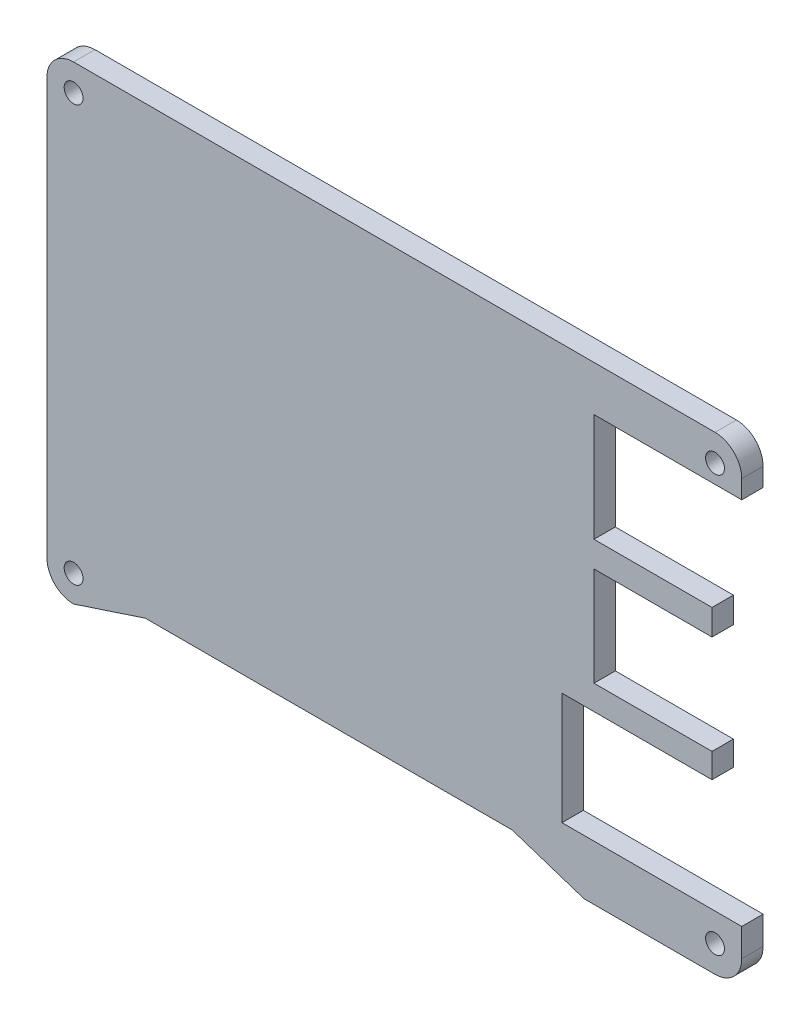
ISO-10303-21;
HEADER;
FILE_DESCRIPTION(('STEP AP214'),'2;1');
FILE_NAME('part.step','',(''),(''),'','','');
FILE_SCHEMA(('AUTOMOTIVE_DESIGN { 1 0 10303 214 1 1 1 1 }'));
ENDSEC;
DATA;
#1=APPLICATION_CONTEXT('core data for automotive mechanical design processes');
#2=APPLICATION_PROTOCOL_DEFINITION('international standard','automotive_design',2000,#1);
#3=PRODUCT_CONTEXT('',#1,'mechanical');
#4=PRODUCT('Part','Part','',(#3));
#5=PRODUCT_RELATED_PRODUCT_CATEGORY('part','',(#4));
#6=PRODUCT_DEFINITION_FORMATION('','',#4);
#7=PRODUCT_DEFINITION_CONTEXT('part definition',#1,'design');
#8=PRODUCT_DEFINITION('design','',#6,#7);
#9=PRODUCT_DEFINITION_SHAPE('','',#8);
#10=(LENGTH_UNIT() NAMED_UNIT(*) SI_UNIT(.MILLI.,.METRE.));
#11=(NAMED_UNIT(*) PLANE_ANGLE_UNIT() SI_UNIT($,.RADIAN.));
#12=(NAMED_UNIT(*) SI_UNIT($,.STERADIAN.) SOLID_ANGLE_UNIT());
#13=UNCERTAINTY_MEASURE_WITH_UNIT(LENGTH_MEASURE(1.E-05),#10,'distance_accuracy_value','');
#14=(GEOMETRIC_REPRESENTATION_CONTEXT(3) GLOBAL_UNCERTAINTY_ASSIGNED_CONTEXT((#13)) GLOBAL_UNIT_ASSIGNED_CONTEXT((#10,
#11,#12)) REPRESENTATION_CONTEXT('',''));
#15=CARTESIAN_POINT('',(0.,0.,0.));
#16=DIRECTION('',(0.,0.,1.));
#17=DIRECTION('',(1.,0.,0.));
#18=AXIS2_PLACEMENT_3D('',#15,#16,#17);
#19=CARTESIAN_POINT('',(0.,30.5076943043399,3.048));
#20=DIRECTION('',(0.,-1.,0.));
#21=DIRECTION('',(1.,0.,0.));
#22=AXIS2_PLACEMENT_3D('',#19,#20,#21);
#23=PLANE('',#22);
#24=DIRECTION('',(-1.,0.,0.));
#25=VECTOR('',#24,1.);
#26=CARTESIAN_POINT('',(0.,30.5076943043399,0.));
#27=LINE('',#26,#25);
#28=CARTESIAN_POINT('',(57.4049323750815,30.50769430434,0.));
#29=VERTEX_POINT('',#28);
#30=CARTESIAN_POINT('',(-34.0848926249185,30.5076943043399,0.));
#31=VERTEX_POINT('',#30);
#32=EDGE_CURVE('E236',#29,#31,#27,.T.);
#33=ORIENTED_EDGE('',*,*,#32,.T.);
#34=DIRECTION('',(0.,0.,-1.));
#35=VECTOR('',#34,1.);
#36=CARTESIAN_POINT('',(-34.0848926249185,30.5076943043399,3.048));
#37=LINE('',#36,#35);
#38=CARTESIAN_POINT('',(-34.0848926249185,30.5076943043399,3.048));
#39=VERTEX_POINT('',#38);
#40=EDGE_CURVE('E11',#39,#31,#37,.T.);
#41=ORIENTED_EDGE('',*,*,#40,.F.);
#42=DIRECTION('',(-1.,0.,0.));
#43=VECTOR('',#42,1.);
#44=CARTESIAN_POINT('',(0.,30.5076943043399,3.048));
#45=LINE('',#44,#43);
#46=CARTESIAN_POINT('',(57.4049323750815,30.50769430434,3.048));
#47=VERTEX_POINT('',#46);
#48=EDGE_CURVE('E404',#47,#39,#45,.T.);
#49=ORIENTED_EDGE('',*,*,#48,.F.);
#50=DIRECTION('',(0.,0.,-1.));
#51=VECTOR('',#50,1.);
#52=CARTESIAN_POINT('',(57.4049323750815,30.50769430434,3.048));
#53=LINE('',#52,#51);
#54=EDGE_CURVE('E223',#47,#29,#53,.T.);
#55=ORIENTED_EDGE('',*,*,#54,.T.);
#56=EDGE_LOOP('',(#33,#41,#49,#55));
#57=FACE_BOUND('',#56,.T.);
#58=ADVANCED_FACE('F35',(#57),#23,.F.);
#59=CARTESIAN_POINT('',(-34.0848926249185,26.69769430434,3.048));
#60=DIRECTION('',(0.,0.,-1.));
#61=DIRECTION('',(-1.,0.,0.));
#62=AXIS2_PLACEMENT_3D('',#59,#60,#61);
#63=CYLINDRICAL_SURFACE('',#62,3.80999999999996);
#64=CARTESIAN_POINT('',(-34.0848926249185,26.69769430434,0.));
#65=DIRECTION('',(0.,0.,1.));
#66=DIRECTION('',(1.,0.,0.));
#67=AXIS2_PLACEMENT_3D('',#64,#65,#66);
#68=CIRCLE('',#67,3.80999999999996);
#69=CARTESIAN_POINT('',(-37.8948926249184,26.69769430434,0.));
#70=VERTEX_POINT('',#69);
#71=EDGE_CURVE('E239',#31,#70,#68,.T.);
#72=ORIENTED_EDGE('',*,*,#71,.T.);
#73=DIRECTION('',(0.,0.,-1.));
#74=VECTOR('',#73,1.);
#75=CARTESIAN_POINT('',(-37.8948926249184,26.69769430434,3.048));
#76=LINE('',#75,#74);
#77=CARTESIAN_POINT('',(-37.8948926249184,26.69769430434,3.048));
#78=VERTEX_POINT('',#77);
#79=EDGE_CURVE('E44',#78,#70,#76,.T.);
#80=ORIENTED_EDGE('',*,*,#79,.F.);
#81=CARTESIAN_POINT('',(-34.0848926249185,26.69769430434,3.048));
#82=DIRECTION('',(0.,0.,1.));
#83=DIRECTION('',(1.,0.,0.));
#84=AXIS2_PLACEMENT_3D('',#81,#82,#83);
#85=CIRCLE('',#84,3.80999999999996);
#86=EDGE_CURVE('E139',#39,#78,#85,.T.);
#87=ORIENTED_EDGE('',*,*,#86,.F.);
#88=ORIENTED_EDGE('',*,*,#40,.T.);
#89=EDGE_LOOP('',(#72,#80,#87,#88));
#90=FACE_BOUND('',#89,.T.);
#91=ADVANCED_FACE('F419',(#90),#63,.T.);
#92=CARTESIAN_POINT('',(-37.8948926249184,0.,3.048));
#93=DIRECTION('',(1.,0.,0.));
#94=DIRECTION('',(0.,1.,0.));
#95=AXIS2_PLACEMENT_3D('',#92,#93,#94);
#96=PLANE('',#95);
#97=DIRECTION('',(0.,-1.,0.));
#98=VECTOR('',#97,1.);
#99=CARTESIAN_POINT('',(-37.8948926249184,0.,0.));
#100=LINE('',#99,#98);
#101=CARTESIAN_POINT('',(-37.8948926249185,-32.64100569566,0.));
#102=VERTEX_POINT('',#101);
#103=EDGE_CURVE('E241',#70,#102,#100,.T.);
#104=ORIENTED_EDGE('',*,*,#103,.T.);
#105=DIRECTION('',(0.,0.,-1.));
#106=VECTOR('',#105,1.);
#107=CARTESIAN_POINT('',(-37.8948926249185,-32.64100569566,3.048));
#108=LINE('',#107,#106);
#109=CARTESIAN_POINT('',(-37.8948926249185,-32.64100569566,3.048));
#110=VERTEX_POINT('',#109);
#111=EDGE_CURVE('E333',#110,#102,#108,.T.);
#112=ORIENTED_EDGE('',*,*,#111,.F.);
#113=DIRECTION('',(0.,-1.,0.));
#114=VECTOR('',#113,1.);
#115=CARTESIAN_POINT('',(-37.8948926249184,0.,3.048));
#116=LINE('',#115,#114);
#117=EDGE_CURVE('E341',#78,#110,#116,.T.);
#118=ORIENTED_EDGE('',*,*,#117,.F.);
#119=ORIENTED_EDGE('',*,*,#79,.T.);
#120=EDGE_LOOP('',(#104,#112,#118,#119));
#121=FACE_BOUND('',#120,.T.);
#122=ADVANCED_FACE('F339',(#121),#96,.F.);
#123=CARTESIAN_POINT('',(-34.0848926249185,-32.64100569566,3.048));
#124=DIRECTION('',(0.,0.,-1.));
#125=DIRECTION('',(-1.,0.,0.));
#126=AXIS2_PLACEMENT_3D('',#123,#124,#125);
#127=CYLINDRICAL_SURFACE('',#126,3.80999999999998);
#128=CARTESIAN_POINT('',(-34.0848926249185,-32.64100569566,0.));
#129=DIRECTION('',(0.,0.,1.));
#130=DIRECTION('',(1.,0.,0.));
#131=AXIS2_PLACEMENT_3D('',#128,#129,#130);
#132=CIRCLE('',#131,3.80999999999998);
#133=CARTESIAN_POINT('',(-34.0848926249185,-36.45100569566,0.));
#134=VERTEX_POINT('',#133);
#135=EDGE_CURVE('E243',#102,#134,#132,.T.);
#136=ORIENTED_EDGE('',*,*,#135,.T.);
#137=DIRECTION('',(0.,0.,-1.));
#138=VECTOR('',#137,1.);
#139=CARTESIAN_POINT('',(-34.0848926249185,-36.45100569566,3.048));
#140=LINE('',#139,#138);
#141=CARTESIAN_POINT('',(-34.0848926249185,-36.45100569566,3.048));
#142=VERTEX_POINT('',#141);
#143=EDGE_CURVE('E330',#142,#134,#140,.T.);
#144=ORIENTED_EDGE('',*,*,#143,.F.);
#145=CARTESIAN_POINT('',(-34.0848926249185,-32.64100569566,3.048));
#146=DIRECTION('',(0.,0.,1.));
#147=DIRECTION('',(1.,0.,0.));
#148=AXIS2_PLACEMENT_3D('',#145,#146,#147);
#149=CIRCLE('',#148,3.80999999999998);
#150=EDGE_CURVE('E359',#110,#142,#149,.T.);
#151=ORIENTED_EDGE('',*,*,#150,.F.);
#152=ORIENTED_EDGE('',*,*,#111,.T.);
#153=EDGE_LOOP('',(#136,#144,#151,#152));
#154=FACE_BOUND('',#153,.T.);
#155=ADVANCED_FACE('F350',(#154),#127,.T.);
#156=CARTESIAN_POINT('',(7.49015762515094,-22.7823959132495,3.048));
#157=DIRECTION('',(-0.312323139313539,0.949975924247207,0.));
#158=DIRECTION('',(-0.949975924247207,-0.312323139313539,0.));
#159=AXIS2_PLACEMENT_3D('',#156,#157,#158);
#160=PLANE('',#159);
#161=DIRECTION('',(0.949975924247208,0.312323139313539,0.));
#162=VECTOR('',#161,1.);
#163=CARTESIAN_POINT('',(7.49015762515094,-22.7823959132495,0.));
#164=LINE('',#163,#162);
#165=CARTESIAN_POINT('',(-23.8448926249185,-33.08440569566,0.));
#166=VERTEX_POINT('',#165);
#167=EDGE_CURVE('E245',#134,#166,#164,.T.);
#168=ORIENTED_EDGE('',*,*,#167,.T.);
#169=DIRECTION('',(0.,0.,-1.));
#170=VECTOR('',#169,1.);
#171=CARTESIAN_POINT('',(-23.8448926249185,-33.08440569566,3.048));
#172=LINE('',#171,#170);
#173=CARTESIAN_POINT('',(-23.8448926249185,-33.08440569566,3.048));
#174=VERTEX_POINT('',#173);
#175=EDGE_CURVE('E327',#174,#166,#172,.T.);
#176=ORIENTED_EDGE('',*,*,#175,.F.);
#177=DIRECTION('',(0.949975924247208,0.312323139313539,0.));
#178=VECTOR('',#177,1.);
#179=CARTESIAN_POINT('',(7.49015762515094,-22.7823959132495,3.048));
#180=LINE('',#179,#178);
#181=EDGE_CURVE('E356',#142,#174,#180,.T.);
#182=ORIENTED_EDGE('',*,*,#181,.F.);
#183=ORIENTED_EDGE('',*,*,#143,.T.);
#184=EDGE_LOOP('',(#168,#176,#182,#183));
#185=FACE_BOUND('',#184,.T.);
#186=ADVANCED_FACE('F354',(#185),#160,.F.);
#187=CARTESIAN_POINT('',(0.,-33.08440569566,3.048));
#188=DIRECTION('',(0.,1.,0.));
#189=DIRECTION('',(-1.,0.,0.));
#190=AXIS2_PLACEMENT_3D('',#187,#188,#189);
#191=PLANE('',#190);
#192=DIRECTION('',(1.,0.,0.));
#193=VECTOR('',#192,1.);
#194=CARTESIAN_POINT('',(0.,-33.08440569566,0.));
#195=LINE('',#194,#193);
#196=CARTESIAN_POINT('',(28.4743073750815,-33.08440569566,0.));
#197=VERTEX_POINT('',#196);
#198=EDGE_CURVE('E247',#166,#197,#195,.T.);
#199=ORIENTED_EDGE('',*,*,#198,.T.);
#200=DIRECTION('',(0.,0.,-1.));
#201=VECTOR('',#200,1.);
#202=CARTESIAN_POINT('',(28.4743073750815,-33.08440569566,3.048));
#203=LINE('',#202,#201);
#204=CARTESIAN_POINT('',(28.4743073750815,-33.08440569566,3.048));
#205=VERTEX_POINT('',#204);
#206=EDGE_CURVE('E324',#205,#197,#203,.T.);
#207=ORIENTED_EDGE('',*,*,#206,.F.);
#208=DIRECTION('',(1.,0.,0.));
#209=VECTOR('',#208,1.);
#210=CARTESIAN_POINT('',(0.,-33.08440569566,3.048));
#211=LINE('',#210,#209);
#212=EDGE_CURVE('E358',#174,#205,#211,.T.);
#213=ORIENTED_EDGE('',*,*,#212,.F.);
#214=ORIENTED_EDGE('',*,*,#175,.T.);
#215=EDGE_LOOP('',(#199,#207,#213,#214));
#216=FACE_BOUND('',#215,.T.);
#217=ADVANCED_FACE('F639',(#216),#191,.F.);
#218=CARTESIAN_POINT('',(-7.03857792206775,-21.4088510431814,3.048));
#219=DIRECTION('',(0.312323139313538,0.949975924247208,0.));
#220=DIRECTION('',(-0.949975924247208,0.312323139313538,0.));
#221=AXIS2_PLACEMENT_3D('',#218,#219,#220);
#222=PLANE('',#221);
#223=DIRECTION('',(0.949975924247208,-0.312323139313538,0.));
#224=VECTOR('',#223,1.);
#225=CARTESIAN_POINT('',(-7.03857792206775,-21.4088510431814,0.));
#226=LINE('',#225,#224);
#227=CARTESIAN_POINT('',(38.7143073750815,-36.45100569566,0.));
#228=VERTEX_POINT('',#227);
#229=EDGE_CURVE('E249',#197,#228,#226,.T.);
#230=ORIENTED_EDGE('',*,*,#229,.T.);
#231=DIRECTION('',(0.,0.,-1.));
#232=VECTOR('',#231,1.);
#233=CARTESIAN_POINT('',(38.7143073750815,-36.45100569566,3.048));
#234=LINE('',#233,#232);
#235=CARTESIAN_POINT('',(38.7143073750815,-36.45100569566,3.048));
#236=VERTEX_POINT('',#235);
#237=EDGE_CURVE('E321',#236,#228,#234,.T.);
#238=ORIENTED_EDGE('',*,*,#237,.F.);
#239=DIRECTION('',(0.949975924247208,-0.312323139313538,0.));
#240=VECTOR('',#239,1.);
#241=CARTESIAN_POINT('',(-7.03857792206775,-21.4088510431814,3.048));
#242=LINE('',#241,#240);
#243=EDGE_CURVE('E361',#205,#236,#242,.T.);
#244=ORIENTED_EDGE('',*,*,#243,.F.);
#245=ORIENTED_EDGE('',*,*,#206,.T.);
#246=EDGE_LOOP('',(#230,#238,#244,#245));
#247=FACE_BOUND('',#246,.T.);
#248=ADVANCED_FACE('F629',(#247),#222,.F.);
#249=CARTESIAN_POINT('',(0.,-36.45100569566,3.048));
#250=DIRECTION('',(0.,1.,0.));
#251=DIRECTION('',(0.,0.,1.));
#252=AXIS2_PLACEMENT_3D('',#249,#250,#251);
#253=PLANE('',#252);
#254=DIRECTION('',(1.,0.,0.));
#255=VECTOR('',#254,1.);
#256=CARTESIAN_POINT('',(0.,-36.45100569566,0.));
#257=LINE('',#256,#255);
#258=CARTESIAN_POINT('',(57.4050073750816,-36.45100569566,0.));
#259=VERTEX_POINT('',#258);
#260=EDGE_CURVE('E251',#228,#259,#257,.T.);
#261=ORIENTED_EDGE('',*,*,#260,.T.);
#262=DIRECTION('',(0.,0.,-1.));
#263=VECTOR('',#262,1.);
#264=CARTESIAN_POINT('',(57.4050073750816,-36.45100569566,3.048));
#265=LINE('',#264,#263);
#266=CARTESIAN_POINT('',(57.4050073750816,-36.45100569566,3.048));
#267=VERTEX_POINT('',#266);
#268=EDGE_CURVE('E318',#267,#259,#265,.T.);
#269=ORIENTED_EDGE('',*,*,#268,.F.);
#270=DIRECTION('',(1.,0.,0.));
#271=VECTOR('',#270,1.);
#272=CARTESIAN_POINT('',(0.,-36.45100569566,3.048));
#273=LINE('',#272,#271);
#274=EDGE_CURVE('E367',#236,#267,#273,.T.);
#275=ORIENTED_EDGE('',*,*,#274,.F.);
#276=ORIENTED_EDGE('',*,*,#237,.T.);
#277=EDGE_LOOP('',(#261,#269,#275,#276));
#278=FACE_BOUND('',#277,.T.);
#279=ADVANCED_FACE('F619',(#278),#253,.F.);
#280=CARTESIAN_POINT('',(57.4050073750816,-32.64100569566,3.048));
#281=DIRECTION('',(0.,0.,-1.));
#282=DIRECTION('',(-1.,0.,0.));
#283=AXIS2_PLACEMENT_3D('',#280,#281,#282);
#284=CYLINDRICAL_SURFACE('',#283,3.81);
#285=CARTESIAN_POINT('',(57.4050073750816,-32.64100569566,0.));
#286=DIRECTION('',(0.,0.,1.));
#287=DIRECTION('',(1.,0.,0.));
#288=AXIS2_PLACEMENT_3D('',#285,#286,#287);
#289=CIRCLE('',#288,3.81);
#290=CARTESIAN_POINT('',(61.2149073750816,-32.6134015293044,0.));
#291=VERTEX_POINT('',#290);
#292=EDGE_CURVE('E253',#259,#291,#289,.T.);
#293=ORIENTED_EDGE('',*,*,#292,.T.);
#294=DIRECTION('',(0.,0.,-1.));
#295=VECTOR('',#294,1.);
#296=CARTESIAN_POINT('',(61.2149073750816,-32.6134015293044,3.048));
#297=LINE('',#296,#295);
#298=CARTESIAN_POINT('',(61.2149073750816,-32.6134015293044,3.048));
#299=VERTEX_POINT('',#298);
#300=EDGE_CURVE('E315',#299,#291,#297,.T.);
#301=ORIENTED_EDGE('',*,*,#300,.F.);
#302=CARTESIAN_POINT('',(57.4050073750816,-32.64100569566,3.048));
#303=DIRECTION('',(0.,0.,1.));
#304=DIRECTION('',(1.,0.,0.));
#305=AXIS2_PLACEMENT_3D('',#302,#303,#304);
#306=CIRCLE('',#305,3.81);
#307=EDGE_CURVE('E369',#267,#299,#306,.T.);
#308=ORIENTED_EDGE('',*,*,#307,.F.);
#309=ORIENTED_EDGE('',*,*,#268,.T.);
#310=EDGE_LOOP('',(#293,#301,#308,#309));
#311=FACE_BOUND('',#310,.T.);
#312=ADVANCED_FACE('F609',(#311),#284,.T.);
#313=CARTESIAN_POINT('',(61.2149073750816,0.,3.048));
#314=DIRECTION('',(-1.,0.,0.));
#315=DIRECTION('',(0.,0.,1.));
#316=AXIS2_PLACEMENT_3D('',#313,#314,#315);
#317=PLANE('',#316);
#318=DIRECTION('',(0.,1.,0.));
#319=VECTOR('',#318,1.);
#320=CARTESIAN_POINT('',(61.2149073750816,0.,0.));
#321=LINE('',#320,#319);
#322=CARTESIAN_POINT('',(61.2149073750816,-28.62780569566,0.));
#323=VERTEX_POINT('',#322);
#324=EDGE_CURVE('E255',#291,#323,#321,.T.);
#325=ORIENTED_EDGE('',*,*,#324,.T.);
#326=DIRECTION('',(0.,0.,-1.));
#327=VECTOR('',#326,1.);
#328=CARTESIAN_POINT('',(61.2149073750816,-28.62780569566,3.048));
#329=LINE('',#328,#327);
#330=CARTESIAN_POINT('',(61.2149073750816,-28.62780569566,3.048));
#331=VERTEX_POINT('',#330);
#332=EDGE_CURVE('E312',#331,#323,#329,.T.);
#333=ORIENTED_EDGE('',*,*,#332,.F.);
#334=DIRECTION('',(0.,1.,0.));
#335=VECTOR('',#334,1.);
#336=CARTESIAN_POINT('',(61.2149073750816,0.,3.048));
#337=LINE('',#336,#335);
#338=EDGE_CURVE('E371',#299,#331,#337,.T.);
#339=ORIENTED_EDGE('',*,*,#338,.F.);
#340=ORIENTED_EDGE('',*,*,#300,.T.);
#341=EDGE_LOOP('',(#325,#333,#339,#340));
#342=FACE_BOUND('',#341,.T.);
#343=ADVANCED_FACE('F599',(#342),#317,.F.);
#344=CARTESIAN_POINT('',(0.,-28.62780569566,3.048));
#345=DIRECTION('',(0.,-1.,0.));
#346=DIRECTION('',(0.,0.,-1.));
#347=AXIS2_PLACEMENT_3D('',#344,#345,#346);
#348=PLANE('',#347);
#349=DIRECTION('',(-1.,0.,0.));
#350=VECTOR('',#349,1.);
#351=CARTESIAN_POINT('',(0.,-28.62780569566,0.));
#352=LINE('',#351,#350);
#353=CARTESIAN_POINT('',(35.5750073750816,-28.62780569566,0.));
#354=VERTEX_POINT('',#353);
#355=EDGE_CURVE('E257',#323,#354,#352,.T.);
#356=ORIENTED_EDGE('',*,*,#355,.T.);
#357=DIRECTION('',(0.,0.,-1.));
#358=VECTOR('',#357,1.);
#359=CARTESIAN_POINT('',(35.5750073750816,-28.62780569566,3.048));
#360=LINE('',#359,#358);
#361=CARTESIAN_POINT('',(35.5750073750816,-28.62780569566,3.048));
#362=VERTEX_POINT('',#361);
#363=EDGE_CURVE('E309',#362,#354,#360,.T.);
#364=ORIENTED_EDGE('',*,*,#363,.F.);
#365=DIRECTION('',(-1.,0.,0.));
#366=VECTOR('',#365,1.);
#367=CARTESIAN_POINT('',(0.,-28.62780569566,3.048));
#368=LINE('',#367,#366);
#369=EDGE_CURVE('E373',#331,#362,#368,.T.);
#370=ORIENTED_EDGE('',*,*,#369,.F.);
#371=ORIENTED_EDGE('',*,*,#332,.T.);
#372=EDGE_LOOP('',(#356,#364,#370,#371));
#373=FACE_BOUND('',#372,.T.);
#374=ADVANCED_FACE('F589',(#373),#348,.F.);
#375=CARTESIAN_POINT('',(35.5750073750816,0.,3.048));
#376=DIRECTION('',(-1.,0.,0.));
#377=DIRECTION('',(0.,0.,1.));
#378=AXIS2_PLACEMENT_3D('',#375,#376,#377);
#379=PLANE('',#378);
#380=DIRECTION('',(0.,1.,0.));
#381=VECTOR('',#380,1.);
#382=CARTESIAN_POINT('',(35.5750073750816,0.,0.));
#383=LINE('',#382,#381);
#384=CARTESIAN_POINT('',(35.5750073750816,-12.62800569566,0.));
#385=VERTEX_POINT('',#384);
#386=EDGE_CURVE('E259',#354,#385,#383,.T.);
#387=ORIENTED_EDGE('',*,*,#386,.T.);
#388=DIRECTION('',(0.,0.,-1.));
#389=VECTOR('',#388,1.);
#390=CARTESIAN_POINT('',(35.5750073750816,-12.62800569566,3.048));
#391=LINE('',#390,#389);
#392=CARTESIAN_POINT('',(35.5750073750816,-12.62800569566,3.048));
#393=VERTEX_POINT('',#392);
#394=EDGE_CURVE('E306',#393,#385,#391,.T.);
#395=ORIENTED_EDGE('',*,*,#394,.F.);
#396=DIRECTION('',(0.,1.,0.));
#397=VECTOR('',#396,1.);
#398=CARTESIAN_POINT('',(35.5750073750816,0.,3.048));
#399=LINE('',#398,#397);
#400=EDGE_CURVE('E375',#362,#393,#399,.T.);
#401=ORIENTED_EDGE('',*,*,#400,.F.);
#402=ORIENTED_EDGE('',*,*,#363,.T.);
#403=EDGE_LOOP('',(#387,#395,#401,#402));
#404=FACE_BOUND('',#403,.T.);
#405=ADVANCED_FACE('F579',(#404),#379,.F.);
#406=CARTESIAN_POINT('',(0.,-12.62800569566,3.048));
#407=DIRECTION('',(0.,1.,0.));
#408=DIRECTION('',(-1.,0.,0.));
#409=AXIS2_PLACEMENT_3D('',#406,#407,#408);
#410=PLANE('',#409);
#411=DIRECTION('',(1.,0.,0.));
#412=VECTOR('',#411,1.);
#413=CARTESIAN_POINT('',(0.,-12.62800569566,0.));
#414=LINE('',#413,#412);
#415=CARTESIAN_POINT('',(56.9750073750815,-12.62800569566,0.));
#416=VERTEX_POINT('',#415);
#417=EDGE_CURVE('E261',#385,#416,#414,.T.);
#418=ORIENTED_EDGE('',*,*,#417,.T.);
#419=DIRECTION('',(0.,0.,-1.));
#420=VECTOR('',#419,1.);
#421=CARTESIAN_POINT('',(56.9750073750815,-12.62800569566,3.048));
#422=LINE('',#421,#420);
#423=CARTESIAN_POINT('',(56.9750073750815,-12.62800569566,3.048));
#424=VERTEX_POINT('',#423);
#425=EDGE_CURVE('E303',#424,#416,#422,.T.);
#426=ORIENTED_EDGE('',*,*,#425,.F.);
#427=DIRECTION('',(1.,0.,0.));
#428=VECTOR('',#427,1.);
#429=CARTESIAN_POINT('',(0.,-12.62800569566,3.048));
#430=LINE('',#429,#428);
#431=EDGE_CURVE('E377',#393,#424,#430,.T.);
#432=ORIENTED_EDGE('',*,*,#431,.F.);
#433=ORIENTED_EDGE('',*,*,#394,.T.);
#434=EDGE_LOOP('',(#418,#426,#432,#433));
#435=FACE_BOUND('',#434,.T.);
#436=ADVANCED_FACE('F569',(#435),#410,.F.);
#437=CARTESIAN_POINT('',(56.9750073750815,0.,3.048));
#438=DIRECTION('',(-1.,0.,0.));
#439=DIRECTION('',(0.,0.,1.));
#440=AXIS2_PLACEMENT_3D('',#437,#438,#439);
#441=PLANE('',#440);
#442=DIRECTION('',(0.,1.,0.));
#443=VECTOR('',#442,1.);
#444=CARTESIAN_POINT('',(56.9750073750815,0.,0.));
#445=LINE('',#444,#443);
#446=CARTESIAN_POINT('',(56.9750073750815,-9.12180569566001,0.));
#447=VERTEX_POINT('',#446);
#448=EDGE_CURVE('E263',#416,#447,#445,.T.);
#449=ORIENTED_EDGE('',*,*,#448,.T.);
#450=DIRECTION('',(0.,0.,-1.));
#451=VECTOR('',#450,1.);
#452=CARTESIAN_POINT('',(56.9750073750815,-9.12180569566001,3.048));
#453=LINE('',#452,#451);
#454=CARTESIAN_POINT('',(56.9750073750815,-9.12180569566001,3.048));
#455=VERTEX_POINT('',#454);
#456=EDGE_CURVE('E301',#455,#447,#453,.T.);
#457=ORIENTED_EDGE('',*,*,#456,.F.);
#458=DIRECTION('',(0.,1.,0.));
#459=VECTOR('',#458,1.);
#460=CARTESIAN_POINT('',(56.9750073750815,0.,3.048));
#461=LINE('',#460,#459);
#462=EDGE_CURVE('E379',#424,#455,#461,.T.);
#463=ORIENTED_EDGE('',*,*,#462,.F.);
#464=ORIENTED_EDGE('',*,*,#425,.T.);
#465=EDGE_LOOP('',(#449,#457,#463,#464));
#466=FACE_BOUND('',#465,.T.);
#467=ADVANCED_FACE('F559',(#466),#441,.F.);
#468=CARTESIAN_POINT('',(0.,-9.12180569566001,3.048));
#469=DIRECTION('',(0.,1.,0.));
#470=DIRECTION('',(0.,0.,1.));
#471=AXIS2_PLACEMENT_3D('',#468,#469,#470);
#472=PLANE('',#471);
#473=DIRECTION('',(1.,0.,0.));
#474=VECTOR('',#473,1.);
#475=CARTESIAN_POINT('',(0.,-9.12180569566001,0.));
#476=LINE('',#475,#474);
#477=CARTESIAN_POINT('',(40.1348073750816,-9.12180569566001,0.));
#478=VERTEX_POINT('',#477);
#479=EDGE_CURVE('E266',#478,#447,#476,.T.);
#480=ORIENTED_EDGE('',*,*,#479,.F.);
#481=DIRECTION('',(0.,0.,-1.));
#482=VECTOR('',#481,1.);
#483=CARTESIAN_POINT('',(40.1348073750816,-9.12180569566001,3.048));
#484=LINE('',#483,#482);
#485=CARTESIAN_POINT('',(40.1348073750816,-9.12180569566001,3.048));
#486=VERTEX_POINT('',#485);
#487=EDGE_CURVE('E299',#486,#478,#484,.T.);
#488=ORIENTED_EDGE('',*,*,#487,.F.);
#489=DIRECTION('',(1.,0.,0.));
#490=VECTOR('',#489,1.);
#491=CARTESIAN_POINT('',(0.,-9.12180569566001,3.048));
#492=LINE('',#491,#490);
#493=EDGE_CURVE('E381',#486,#455,#492,.T.);
#494=ORIENTED_EDGE('',*,*,#493,.T.);
#495=ORIENTED_EDGE('',*,*,#456,.T.);
#496=EDGE_LOOP('',(#480,#488,#494,#495));
#497=FACE_BOUND('',#496,.T.);
#498=ADVANCED_FACE('F549',(#497),#472,.T.);
#499=CARTESIAN_POINT('',(40.1348073750815,0.,3.048));
#500=DIRECTION('',(1.,0.,0.));
#501=DIRECTION('',(0.,1.,0.));
#502=AXIS2_PLACEMENT_3D('',#499,#500,#501);
#503=PLANE('',#502);
#504=DIRECTION('',(0.,-1.,0.));
#505=VECTOR('',#504,1.);
#506=CARTESIAN_POINT('',(40.1348073750815,0.,0.));
#507=LINE('',#506,#505);
#508=CARTESIAN_POINT('',(40.1348073750815,4.99789430433997,0.));
#509=VERTEX_POINT('',#508);
#510=EDGE_CURVE('E269',#509,#478,#507,.T.);
#511=ORIENTED_EDGE('',*,*,#510,.F.);
#512=DIRECTION('',(0.,0.,-1.));
#513=VECTOR('',#512,1.);
#514=CARTESIAN_POINT('',(40.1348073750815,4.99789430433997,3.048));
#515=LINE('',#514,#513);
#516=CARTESIAN_POINT('',(40.1348073750815,4.99789430433997,3.048));
#517=VERTEX_POINT('',#516);
#518=EDGE_CURVE('E297',#517,#509,#515,.T.);
#519=ORIENTED_EDGE('',*,*,#518,.F.);
#520=DIRECTION('',(0.,-1.,0.));
#521=VECTOR('',#520,1.);
#522=CARTESIAN_POINT('',(40.1348073750815,0.,3.048));
#523=LINE('',#522,#521);
#524=EDGE_CURVE('E384',#517,#486,#523,.T.);
#525=ORIENTED_EDGE('',*,*,#524,.T.);
#526=ORIENTED_EDGE('',*,*,#487,.T.);
#527=EDGE_LOOP('',(#511,#519,#525,#526));
#528=FACE_BOUND('',#527,.T.);
#529=ADVANCED_FACE('F539',(#528),#503,.T.);
#530=CARTESIAN_POINT('',(0.,4.99789430433997,3.048));
#531=DIRECTION('',(0.,-1.,0.));
#532=DIRECTION('',(0.,0.,-1.));
#533=AXIS2_PLACEMENT_3D('',#530,#531,#532);
#534=PLANE('',#533);
#535=DIRECTION('',(-1.,0.,0.));
#536=VECTOR('',#535,1.);
#537=CARTESIAN_POINT('',(0.,4.99789430433997,0.));
#538=LINE('',#537,#536);
#539=CARTESIAN_POINT('',(56.9750073750815,4.99789430433997,0.));
#540=VERTEX_POINT('',#539);
#541=EDGE_CURVE('E272',#540,#509,#538,.T.);
#542=ORIENTED_EDGE('',*,*,#541,.F.);
#543=DIRECTION('',(0.,0.,-1.));
#544=VECTOR('',#543,1.);
#545=CARTESIAN_POINT('',(56.9750073750815,4.99789430433997,3.048));
#546=LINE('',#545,#544);
#547=CARTESIAN_POINT('',(56.9750073750815,4.99789430433997,3.048));
#548=VERTEX_POINT('',#547);
#549=EDGE_CURVE('E295',#548,#540,#546,.T.);
#550=ORIENTED_EDGE('',*,*,#549,.F.);
#551=DIRECTION('',(-1.,0.,0.));
#552=VECTOR('',#551,1.);
#553=CARTESIAN_POINT('',(0.,4.99789430433997,3.048));
#554=LINE('',#553,#552);
#555=EDGE_CURVE('E387',#548,#517,#554,.T.);
#556=ORIENTED_EDGE('',*,*,#555,.T.);
#557=ORIENTED_EDGE('',*,*,#518,.T.);
#558=EDGE_LOOP('',(#542,#550,#556,#557));
#559=FACE_BOUND('',#558,.T.);
#560=ADVANCED_FACE('F529',(#559),#534,.T.);
#561=CARTESIAN_POINT('',(56.9750073750815,0.,3.048));
#562=DIRECTION('',(-1.,0.,0.));
#563=DIRECTION('',(0.,0.,1.));
#564=AXIS2_PLACEMENT_3D('',#561,#562,#563);
#565=PLANE('',#564);
#566=DIRECTION('',(0.,1.,0.));
#567=VECTOR('',#566,1.);
#568=CARTESIAN_POINT('',(56.9750073750815,0.,0.));
#569=LINE('',#568,#567);
#570=CARTESIAN_POINT('',(56.9750073750815,8.65819430433998,0.));
#571=VERTEX_POINT('',#570);
#572=EDGE_CURVE('E275',#540,#571,#569,.T.);
#573=ORIENTED_EDGE('',*,*,#572,.T.);
#574=DIRECTION('',(0.,0.,-1.));
#575=VECTOR('',#574,1.);
#576=CARTESIAN_POINT('',(56.9750073750815,8.65819430433998,3.048));
#577=LINE('',#576,#575);
#578=CARTESIAN_POINT('',(56.9750073750815,8.65819430433998,3.048));
#579=VERTEX_POINT('',#578);
#580=EDGE_CURVE('E293',#579,#571,#577,.T.);
#581=ORIENTED_EDGE('',*,*,#580,.F.);
#582=DIRECTION('',(0.,1.,0.));
#583=VECTOR('',#582,1.);
#584=CARTESIAN_POINT('',(56.9750073750815,0.,3.048));
#585=LINE('',#584,#583);
#586=EDGE_CURVE('E390',#548,#579,#585,.T.);
#587=ORIENTED_EDGE('',*,*,#586,.F.);
#588=ORIENTED_EDGE('',*,*,#549,.T.);
#589=EDGE_LOOP('',(#573,#581,#587,#588));
#590=FACE_BOUND('',#589,.T.);
#591=ADVANCED_FACE('F520',(#590),#565,.F.);
#592=CARTESIAN_POINT('',(0.,8.65819430433998,3.048));
#593=DIRECTION('',(0.,1.,0.));
#594=DIRECTION('',(-1.,0.,0.));
#595=AXIS2_PLACEMENT_3D('',#592,#593,#594);
#596=PLANE('',#595);
#597=DIRECTION('',(1.,0.,0.));
#598=VECTOR('',#597,1.);
#599=CARTESIAN_POINT('',(0.,8.65819430433998,0.));
#600=LINE('',#599,#598);
#601=CARTESIAN_POINT('',(40.1348073750816,8.65819430433998,0.));
#602=VERTEX_POINT('',#601);
#603=EDGE_CURVE('E278',#602,#571,#600,.T.);
#604=ORIENTED_EDGE('',*,*,#603,.F.);
#605=DIRECTION('',(0.,0.,-1.));
#606=VECTOR('',#605,1.);
#607=CARTESIAN_POINT('',(40.1348073750816,8.65819430433998,3.048));
#608=LINE('',#607,#606);
#609=CARTESIAN_POINT('',(40.1348073750816,8.65819430433998,3.048));
#610=VERTEX_POINT('',#609);
#611=EDGE_CURVE('E291',#610,#602,#608,.T.);
#612=ORIENTED_EDGE('',*,*,#611,.F.);
#613=DIRECTION('',(1.,0.,0.));
#614=VECTOR('',#613,1.);
#615=CARTESIAN_POINT('',(0.,8.65819430433998,3.048));
#616=LINE('',#615,#614);
#617=EDGE_CURVE('E218',#610,#579,#616,.T.);
#618=ORIENTED_EDGE('',*,*,#617,.T.);
#619=ORIENTED_EDGE('',*,*,#580,.T.);
#620=EDGE_LOOP('',(#604,#612,#618,#619));
#621=FACE_BOUND('',#620,.T.);
#622=ADVANCED_FACE('F394',(#621),#596,.T.);
#623=CARTESIAN_POINT('',(40.1348073750816,0.,3.048));
#624=DIRECTION('',(1.,0.,0.));
#625=DIRECTION('',(0.,0.,-1.));
#626=AXIS2_PLACEMENT_3D('',#623,#624,#625);
#627=PLANE('',#626);
#628=DIRECTION('',(0.,-1.,0.));
#629=VECTOR('',#628,1.);
#630=CARTESIAN_POINT('',(40.1348073750816,0.,0.));
#631=LINE('',#630,#629);
#632=CARTESIAN_POINT('',(40.1348073750816,24.06829430434,0.));
#633=VERTEX_POINT('',#632);
#634=EDGE_CURVE('E281',#633,#602,#631,.T.);
#635=ORIENTED_EDGE('',*,*,#634,.F.);
#636=DIRECTION('',(0.,0.,-1.));
#637=VECTOR('',#636,1.);
#638=CARTESIAN_POINT('',(40.1348073750816,24.06829430434,3.048));
#639=LINE('',#638,#637);
#640=CARTESIAN_POINT('',(40.1348073750816,24.06829430434,3.048));
#641=VERTEX_POINT('',#640);
#642=EDGE_CURVE('E206',#641,#633,#639,.T.);
#643=ORIENTED_EDGE('',*,*,#642,.F.);
#644=DIRECTION('',(0.,-1.,0.));
#645=VECTOR('',#644,1.);
#646=CARTESIAN_POINT('',(40.1348073750816,0.,3.048));
#647=LINE('',#646,#645);
#648=EDGE_CURVE('E216',#641,#610,#647,.T.);
#649=ORIENTED_EDGE('',*,*,#648,.T.);
#650=ORIENTED_EDGE('',*,*,#611,.T.);
#651=EDGE_LOOP('',(#635,#643,#649,#650));
#652=FACE_BOUND('',#651,.T.);
#653=ADVANCED_FACE('F400',(#652),#627,.T.);
#654=CARTESIAN_POINT('',(0.,24.06829430434,3.048));
#655=DIRECTION('',(0.,-1.,0.));
#656=DIRECTION('',(0.,0.,-1.));
#657=AXIS2_PLACEMENT_3D('',#654,#655,#656);
#658=PLANE('',#657);
#659=DIRECTION('',(-1.,0.,0.));
#660=VECTOR('',#659,1.);
#661=CARTESIAN_POINT('',(0.,24.06829430434,0.));
#662=LINE('',#661,#660);
#663=CARTESIAN_POINT('',(61.2149073750816,24.06829430434,0.));
#664=VERTEX_POINT('',#663);
#665=EDGE_CURVE('E205',#664,#633,#662,.T.);
#666=ORIENTED_EDGE('',*,*,#665,.F.);
#667=DIRECTION('',(0.,0.,-1.));
#668=VECTOR('',#667,1.);
#669=CARTESIAN_POINT('',(61.2149073750816,24.06829430434,3.048));
#670=LINE('',#669,#668);
#671=CARTESIAN_POINT('',(61.2149073750816,24.06829430434,3.048));
#672=VERTEX_POINT('',#671);
#673=EDGE_CURVE('E199',#672,#664,#670,.T.);
#674=ORIENTED_EDGE('',*,*,#673,.F.);
#675=DIRECTION('',(-1.,0.,0.));
#676=VECTOR('',#675,1.);
#677=CARTESIAN_POINT('',(0.,24.06829430434,3.048));
#678=LINE('',#677,#676);
#679=EDGE_CURVE('E203',#672,#641,#678,.T.);
#680=ORIENTED_EDGE('',*,*,#679,.T.);
#681=ORIENTED_EDGE('',*,*,#642,.T.);
#682=EDGE_LOOP('',(#666,#674,#680,#681));
#683=FACE_BOUND('',#682,.T.);
#684=ADVANCED_FACE('F201',(#683),#658,.T.);
#685=CARTESIAN_POINT('',(61.2149073750816,0.,3.048));
#686=DIRECTION('',(-1.,0.,0.));
#687=DIRECTION('',(0.,0.,1.));
#688=AXIS2_PLACEMENT_3D('',#685,#686,#687);
#689=PLANE('',#688);
#690=DIRECTION('',(0.,1.,0.));
#691=VECTOR('',#690,1.);
#692=CARTESIAN_POINT('',(61.2149073750816,0.,0.));
#693=LINE('',#692,#691);
#694=CARTESIAN_POINT('',(61.2149073750816,26.6838921532431,0.));
#695=VERTEX_POINT('',#694);
#696=EDGE_CURVE('E125',#664,#695,#693,.T.);
#697=ORIENTED_EDGE('',*,*,#696,.T.);
#698=DIRECTION('',(0.,0.,-1.));
#699=VECTOR('',#698,1.);
#700=CARTESIAN_POINT('',(61.2149073750816,26.6838921532431,3.048));
#701=LINE('',#700,#699);
#702=CARTESIAN_POINT('',(61.2149073750816,26.6838921532431,3.048));
#703=VERTEX_POINT('',#702);
#704=EDGE_CURVE('E207',#703,#695,#701,.T.);
#705=ORIENTED_EDGE('',*,*,#704,.F.);
#706=DIRECTION('',(0.,1.,0.));
#707=VECTOR('',#706,1.);
#708=CARTESIAN_POINT('',(61.2149073750816,0.,3.048));
#709=LINE('',#708,#707);
#710=EDGE_CURVE('E209',#672,#703,#709,.T.);
#711=ORIENTED_EDGE('',*,*,#710,.F.);
#712=ORIENTED_EDGE('',*,*,#673,.T.);
#713=EDGE_LOOP('',(#697,#705,#711,#712));
#714=FACE_BOUND('',#713,.T.);
#715=ADVANCED_FACE('F210',(#714),#689,.F.);
#716=CARTESIAN_POINT('',(57.4049323750815,26.69769430434,3.048));
#717=DIRECTION('',(0.,0.,-1.));
#718=DIRECTION('',(-1.,0.,0.));
#719=AXIS2_PLACEMENT_3D('',#716,#717,#718);
#720=CYLINDRICAL_SURFACE('',#719,1.34620000000002);
#721=CARTESIAN_POINT('',(57.4049323750815,26.69769430434,3.048));
#722=DIRECTION('',(0.,0.,1.));
#723=DIRECTION('',(1.,0.,0.));
#724=AXIS2_PLACEMENT_3D('',#721,#722,#723);
#725=CIRCLE('',#724,1.34620000000002);
#726=CARTESIAN_POINT('',(58.7511323750816,26.69769430434,3.048));
#727=VERTEX_POINT('',#726);
#728=EDGE_CURVE('E727',#727,#727,#725,.T.);
#729=ORIENTED_EDGE('',*,*,#728,.T.);
#730=EDGE_LOOP('',(#729));
#731=FACE_BOUND('',#730,.T.);
#732=CARTESIAN_POINT('',(57.4049323750815,26.69769430434,0.));
#733=DIRECTION('',(0.,0.,1.));
#734=DIRECTION('',(1.,0.,0.));
#735=AXIS2_PLACEMENT_3D('',#732,#733,#734);
#736=CIRCLE('',#735,1.34620000000002);
#737=CARTESIAN_POINT('',(58.7511323750816,26.69769430434,0.));
#738=VERTEX_POINT('',#737);
#739=EDGE_CURVE('E233',#738,#738,#736,.T.);
#740=ORIENTED_EDGE('',*,*,#739,.F.);
#741=EDGE_LOOP('',(#740));
#742=FACE_BOUND('',#741,.T.);
#743=ADVANCED_FACE('F427',(#731,#742),#720,.F.);
#744=CARTESIAN_POINT('',(-34.0848926249185,26.69769430434,3.048));
#745=DIRECTION('',(0.,0.,-1.));
#746=DIRECTION('',(-1.,0.,0.));
#747=AXIS2_PLACEMENT_3D('',#744,#745,#746);
#748=CYLINDRICAL_SURFACE('',#747,1.34620000000002);
#749=CARTESIAN_POINT('',(-34.0848926249185,26.69769430434,3.048));
#750=DIRECTION('',(0.,0.,1.));
#751=DIRECTION('',(1.,0.,0.));
#752=AXIS2_PLACEMENT_3D('',#749,#750,#751);
#753=CIRCLE('',#752,1.34620000000002);
#754=CARTESIAN_POINT('',(-32.7386926249185,26.69769430434,3.048));
#755=VERTEX_POINT('',#754);
#756=EDGE_CURVE('E724',#755,#755,#753,.T.);
#757=ORIENTED_EDGE('',*,*,#756,.T.);
#758=EDGE_LOOP('',(#757));
#759=FACE_BOUND('',#758,.T.);
#760=CARTESIAN_POINT('',(-34.0848926249185,26.69769430434,0.));
#761=DIRECTION('',(0.,0.,1.));
#762=DIRECTION('',(1.,0.,0.));
#763=AXIS2_PLACEMENT_3D('',#760,#761,#762);
#764=CIRCLE('',#763,1.34620000000002);
#765=CARTESIAN_POINT('',(-32.7386926249185,26.69769430434,0.));
#766=VERTEX_POINT('',#765);
#767=EDGE_CURVE('E230',#766,#766,#764,.T.);
#768=ORIENTED_EDGE('',*,*,#767,.F.);
#769=EDGE_LOOP('',(#768));
#770=FACE_BOUND('',#769,.T.);
#771=ADVANCED_FACE('F430',(#759,#770),#748,.F.);
#772=CARTESIAN_POINT('',(-34.0848926249185,-32.64100569566,3.048));
#773=DIRECTION('',(0.,0.,-1.));
#774=DIRECTION('',(-1.,0.,0.));
#775=AXIS2_PLACEMENT_3D('',#772,#773,#774);
#776=CYLINDRICAL_SURFACE('',#775,1.34620000000002);
#777=CARTESIAN_POINT('',(-34.0848926249185,-32.64100569566,3.048));
#778=DIRECTION('',(0.,0.,1.));
#779=DIRECTION('',(1.,0.,0.));
#780=AXIS2_PLACEMENT_3D('',#777,#778,#779);
#781=CIRCLE('',#780,1.34620000000002);
#782=CARTESIAN_POINT('',(-32.7386926249185,-32.64100569566,3.048));
#783=VERTEX_POINT('',#782);
#784=EDGE_CURVE('E441',#783,#783,#781,.T.);
#785=ORIENTED_EDGE('',*,*,#784,.T.);
#786=EDGE_LOOP('',(#785));
#787=FACE_BOUND('',#786,.T.);
#788=CARTESIAN_POINT('',(-34.0848926249185,-32.64100569566,0.));
#789=DIRECTION('',(0.,0.,1.));
#790=DIRECTION('',(1.,0.,0.));
#791=AXIS2_PLACEMENT_3D('',#788,#789,#790);
#792=CIRCLE('',#791,1.34620000000002);
#793=CARTESIAN_POINT('',(-32.7386926249185,-32.64100569566,0.));
#794=VERTEX_POINT('',#793);
#795=EDGE_CURVE('E227',#794,#794,#792,.T.);
#796=ORIENTED_EDGE('',*,*,#795,.F.);
#797=EDGE_LOOP('',(#796));
#798=FACE_BOUND('',#797,.T.);
#799=ADVANCED_FACE('F414',(#787,#798),#776,.F.);
#800=CARTESIAN_POINT('',(57.4050073750816,-32.64100569566,3.048));
#801=DIRECTION('',(0.,0.,-1.));
#802=DIRECTION('',(-1.,0.,0.));
#803=AXIS2_PLACEMENT_3D('',#800,#801,#802);
#804=CYLINDRICAL_SURFACE('',#803,1.34620000000002);
#805=CARTESIAN_POINT('',(57.4050073750816,-32.64100569566,3.048));
#806=DIRECTION('',(0.,0.,1.));
#807=DIRECTION('',(1.,0.,0.));
#808=AXIS2_PLACEMENT_3D('',#805,#806,#807);
#809=CIRCLE('',#808,1.34620000000002);
#810=CARTESIAN_POINT('',(58.7512073750816,-32.64100569566,3.048));
#811=VERTEX_POINT('',#810);
#812=EDGE_CURVE('E287',#811,#811,#809,.T.);
#813=ORIENTED_EDGE('',*,*,#812,.T.);
#814=EDGE_LOOP('',(#813));
#815=FACE_BOUND('',#814,.T.);
#816=CARTESIAN_POINT('',(57.4050073750816,-32.64100569566,0.));
#817=DIRECTION('',(0.,0.,1.));
#818=DIRECTION('',(1.,0.,0.));
#819=AXIS2_PLACEMENT_3D('',#816,#817,#818);
#820=CIRCLE('',#819,1.34620000000002);
#821=CARTESIAN_POINT('',(58.7512073750816,-32.64100569566,0.));
#822=VERTEX_POINT('',#821);
#823=EDGE_CURVE('E224',#822,#822,#820,.T.);
#824=ORIENTED_EDGE('',*,*,#823,.F.);
#825=EDGE_LOOP('',(#824));
#826=FACE_BOUND('',#825,.T.);
#827=ADVANCED_FACE('F37',(#815,#826),#804,.F.);
#828=CARTESIAN_POINT('',(57.4049323750815,26.69769430434,3.048));
#829=DIRECTION('',(0.,0.,-1.));
#830=DIRECTION('',(-1.,0.,0.));
#831=AXIS2_PLACEMENT_3D('',#828,#829,#830);
#832=CYLINDRICAL_SURFACE('',#831,3.81000000000001);
#833=CARTESIAN_POINT('',(57.4049323750815,26.69769430434,0.));
#834=DIRECTION('',(0.,0.,1.));
#835=DIRECTION('',(1.,0.,0.));
#836=AXIS2_PLACEMENT_3D('',#833,#834,#835);
#837=CIRCLE('',#836,3.81000000000001);
#838=EDGE_CURVE('E131',#695,#29,#837,.T.);
#839=ORIENTED_EDGE('',*,*,#838,.T.);
#840=ORIENTED_EDGE('',*,*,#54,.F.);
#841=CARTESIAN_POINT('',(57.4049323750815,26.69769430434,3.048));
#842=DIRECTION('',(0.,0.,1.));
#843=DIRECTION('',(1.,0.,0.));
#844=AXIS2_PLACEMENT_3D('',#841,#842,#843);
#845=CIRCLE('',#844,3.81000000000001);
#846=EDGE_CURVE('E52',#703,#47,#845,.T.);
#847=ORIENTED_EDGE('',*,*,#846,.F.);
#848=ORIENTED_EDGE('',*,*,#704,.T.);
#849=EDGE_LOOP('',(#839,#840,#847,#848));
#850=FACE_BOUND('',#849,.T.);
#851=ADVANCED_FACE('F405',(#850),#832,.T.);
#852=CARTESIAN_POINT('',(0.,0.,3.048));
#853=DIRECTION('',(0.,0.,1.));
#854=DIRECTION('',(1.,0.,0.));
#855=AXIS2_PLACEMENT_3D('',#852,#853,#854);
#856=PLANE('',#855);
#857=ORIENTED_EDGE('',*,*,#812,.F.);
#858=EDGE_LOOP('',(#857));
#859=FACE_BOUND('',#858,.T.);
#860=ORIENTED_EDGE('',*,*,#784,.F.);
#861=EDGE_LOOP('',(#860));
#862=FACE_BOUND('',#861,.T.);
#863=ORIENTED_EDGE('',*,*,#756,.F.);
#864=EDGE_LOOP('',(#863));
#865=FACE_BOUND('',#864,.T.);
#866=ORIENTED_EDGE('',*,*,#728,.F.);
#867=EDGE_LOOP('',(#866));
#868=FACE_BOUND('',#867,.T.);
#869=ORIENTED_EDGE('',*,*,#48,.T.);
#870=ORIENTED_EDGE('',*,*,#86,.T.);
#871=ORIENTED_EDGE('',*,*,#117,.T.);
#872=ORIENTED_EDGE('',*,*,#150,.T.);
#873=ORIENTED_EDGE('',*,*,#181,.T.);
#874=ORIENTED_EDGE('',*,*,#212,.T.);
#875=ORIENTED_EDGE('',*,*,#243,.T.);
#876=ORIENTED_EDGE('',*,*,#274,.T.);
#877=ORIENTED_EDGE('',*,*,#307,.T.);
#878=ORIENTED_EDGE('',*,*,#338,.T.);
#879=ORIENTED_EDGE('',*,*,#369,.T.);
#880=ORIENTED_EDGE('',*,*,#400,.T.);
#881=ORIENTED_EDGE('',*,*,#431,.T.);
#882=ORIENTED_EDGE('',*,*,#462,.T.);
#883=ORIENTED_EDGE('',*,*,#493,.F.);
#884=ORIENTED_EDGE('',*,*,#524,.F.);
#885=ORIENTED_EDGE('',*,*,#555,.F.);
#886=ORIENTED_EDGE('',*,*,#586,.T.);
#887=ORIENTED_EDGE('',*,*,#617,.F.);
#888=ORIENTED_EDGE('',*,*,#648,.F.);
#889=ORIENTED_EDGE('',*,*,#679,.F.);
#890=ORIENTED_EDGE('',*,*,#710,.T.);
#891=ORIENTED_EDGE('',*,*,#846,.T.);
#892=EDGE_LOOP('',(#869,#870,#871,#872,#873,#874,#875,#876,#877,#878,#879,#880,#881,#882,#883,
#884,#885,#886,#887,#888,#889,#890,#891));
#893=FACE_BOUND('',#892,.T.);
#894=ADVANCED_FACE('F213',(#859,#862,#865,#868,#893),#856,.T.);
#895=CARTESIAN_POINT('',(0.,0.,0.));
#896=DIRECTION('',(0.,0.,1.));
#897=DIRECTION('',(1.,0.,0.));
#898=AXIS2_PLACEMENT_3D('',#895,#896,#897);
#899=PLANE('',#898);
#900=ORIENTED_EDGE('',*,*,#823,.T.);
#901=EDGE_LOOP('',(#900));
#902=FACE_BOUND('',#901,.T.);
#903=ORIENTED_EDGE('',*,*,#795,.T.);
#904=EDGE_LOOP('',(#903));
#905=FACE_BOUND('',#904,.T.);
#906=ORIENTED_EDGE('',*,*,#767,.T.);
#907=EDGE_LOOP('',(#906));
#908=FACE_BOUND('',#907,.T.);
#909=ORIENTED_EDGE('',*,*,#739,.T.);
#910=EDGE_LOOP('',(#909));
#911=FACE_BOUND('',#910,.T.);
#912=ORIENTED_EDGE('',*,*,#32,.F.);
#913=ORIENTED_EDGE('',*,*,#838,.F.);
#914=ORIENTED_EDGE('',*,*,#696,.F.);
#915=ORIENTED_EDGE('',*,*,#665,.T.);
#916=ORIENTED_EDGE('',*,*,#634,.T.);
#917=ORIENTED_EDGE('',*,*,#603,.T.);
#918=ORIENTED_EDGE('',*,*,#572,.F.);
#919=ORIENTED_EDGE('',*,*,#541,.T.);
#920=ORIENTED_EDGE('',*,*,#510,.T.);
#921=ORIENTED_EDGE('',*,*,#479,.T.);
#922=ORIENTED_EDGE('',*,*,#448,.F.);
#923=ORIENTED_EDGE('',*,*,#417,.F.);
#924=ORIENTED_EDGE('',*,*,#386,.F.);
#925=ORIENTED_EDGE('',*,*,#355,.F.);
#926=ORIENTED_EDGE('',*,*,#324,.F.);
#927=ORIENTED_EDGE('',*,*,#292,.F.);
#928=ORIENTED_EDGE('',*,*,#260,.F.);
#929=ORIENTED_EDGE('',*,*,#229,.F.);
#930=ORIENTED_EDGE('',*,*,#198,.F.);
#931=ORIENTED_EDGE('',*,*,#167,.F.);
#932=ORIENTED_EDGE('',*,*,#135,.F.);
#933=ORIENTED_EDGE('',*,*,#103,.F.);
#934=ORIENTED_EDGE('',*,*,#71,.F.);
#935=EDGE_LOOP('',(#912,#913,#914,#915,#916,#917,#918,#919,#920,#921,#922,#923,#924,#925,#926,
#927,#928,#929,#930,#931,#932,#933,#934));
#936=FACE_BOUND('',#935,.T.);
#937=ADVANCED_FACE('F345',(#902,#905,#908,#911,#936),#899,.F.);
#938=CLOSED_SHELL('',(#58,#91,#122,#155,#186,#217,#248,#279,#312,#343,#374,#405,#436,#467,#498,
#529,#560,#591,#622,#653,#684,#715,#743,#771,#799,#827,#851,#894,#937));
#939=MANIFOLD_SOLID_BREP('B2',#938);
#940=ADVANCED_BREP_SHAPE_REPRESENTATION('',(#18,#939),#14);
#941=SHAPE_DEFINITION_REPRESENTATION(#9,#940);
ENDSEC;
END-ISO-10303-21;
